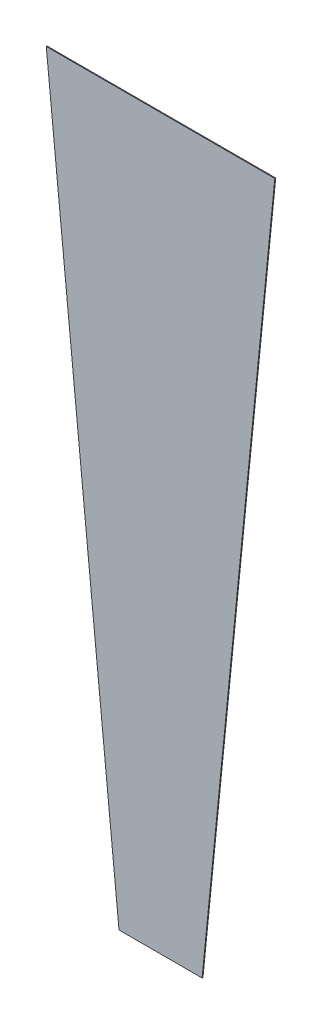
ISO-10303-21;
HEADER;
FILE_DESCRIPTION(('STEP AP214'),'2;1');
FILE_NAME('part.step','',(''),(''),'','','');
FILE_SCHEMA(('AUTOMOTIVE_DESIGN { 1 0 10303 214 1 1 1 1 }'));
ENDSEC;
DATA;
#1=APPLICATION_CONTEXT('core data for automotive mechanical design processes');
#2=APPLICATION_PROTOCOL_DEFINITION('international standard','automotive_design',2000,#1);
#3=PRODUCT_CONTEXT('',#1,'mechanical');
#4=PRODUCT('Part','Part','',(#3));
#5=PRODUCT_RELATED_PRODUCT_CATEGORY('part','',(#4));
#6=PRODUCT_DEFINITION_FORMATION('','',#4);
#7=PRODUCT_DEFINITION_CONTEXT('part definition',#1,'design');
#8=PRODUCT_DEFINITION('design','',#6,#7);
#9=PRODUCT_DEFINITION_SHAPE('','',#8);
#10=(LENGTH_UNIT() NAMED_UNIT(*) SI_UNIT(.MILLI.,.METRE.));
#11=(NAMED_UNIT(*) PLANE_ANGLE_UNIT() SI_UNIT($,.RADIAN.));
#12=(NAMED_UNIT(*) SI_UNIT($,.STERADIAN.) SOLID_ANGLE_UNIT());
#13=UNCERTAINTY_MEASURE_WITH_UNIT(LENGTH_MEASURE(1.E-05),#10,'distance_accuracy_value','');
#14=(GEOMETRIC_REPRESENTATION_CONTEXT(3) GLOBAL_UNCERTAINTY_ASSIGNED_CONTEXT((#13)) GLOBAL_UNIT_ASSIGNED_CONTEXT((#10,
#11,#12)) REPRESENTATION_CONTEXT('',''));
#15=CARTESIAN_POINT('',(0.,0.,0.));
#16=DIRECTION('',(0.,0.,1.));
#17=DIRECTION('',(1.,0.,0.));
#18=AXIS2_PLACEMENT_3D('',#15,#16,#17);
#19=CARTESIAN_POINT('',(-104.963976,-655.465288,6.3754));
#20=DIRECTION('',(0.,0.,1.));
#21=DIRECTION('',(1.,0.,0.));
#22=AXIS2_PLACEMENT_3D('',#19,#20,#21);
#23=PLANE('',#22);
#24=DIRECTION('',(-0.0993248441126649,-0.995055061462427,0.));
#25=VECTOR('',#24,1.);
#26=CARTESIAN_POINT('',(68.8086,-320.8274,6.3754));
#27=LINE('',#26,#25);
#28=CARTESIAN_POINT('',(36.6903,-642.5946,6.3754));
#29=VERTEX_POINT('',#28);
#30=CARTESIAN_POINT('',(100.9269,0.939800000000036,6.3754));
#31=VERTEX_POINT('',#30);
#32=EDGE_CURVE('E87',#29,#31,#27,.F.);
#33=ORIENTED_EDGE('',*,*,#32,.T.);
#34=DIRECTION('',(1.,0.,0.));
#35=VECTOR('',#34,1.);
#36=CARTESIAN_POINT('',(0.,0.9398,6.3754));
#37=LINE('',#36,#35);
#38=CARTESIAN_POINT('',(-100.9269,0.939800000000024,6.3754));
#39=VERTEX_POINT('',#38);
#40=EDGE_CURVE('E67',#31,#39,#37,.F.);
#41=ORIENTED_EDGE('',*,*,#40,.T.);
#42=DIRECTION('',(-0.0993248441126649,0.995055061462427,0.));
#43=VECTOR('',#42,1.);
#44=CARTESIAN_POINT('',(-68.8086,-320.8274,6.3754));
#45=LINE('',#44,#43);
#46=CARTESIAN_POINT('',(-36.6903,-642.5946,6.3754));
#47=VERTEX_POINT('',#46);
#48=EDGE_CURVE('E54',#39,#47,#45,.F.);
#49=ORIENTED_EDGE('',*,*,#48,.T.);
#50=DIRECTION('',(-1.,0.,0.));
#51=VECTOR('',#50,1.);
#52=CARTESIAN_POINT('',(0.,-642.5946,6.3754));
#53=LINE('',#52,#51);
#54=EDGE_CURVE('E65',#47,#29,#53,.F.);
#55=ORIENTED_EDGE('',*,*,#54,.T.);
#56=EDGE_LOOP('',(#33,#41,#49,#55));
#57=FACE_BOUND('',#56,.T.);
#58=ADVANCED_FACE('F17',(#57),#23,.T.);
#59=CARTESIAN_POINT('',(-102.211632,13.810488,5.59816));
#60=DIRECTION('',(-0.995055061462427,-0.0993248441126649,0.));
#61=DIRECTION('',(0.0993248441126649,-0.995055061462427,0.));
#62=AXIS2_PLACEMENT_3D('',#59,#60,#61);
#63=PLANE('',#62);
#64=ORIENTED_EDGE('',*,*,#48,.F.);
#65=DIRECTION('',(0.,0.,1.));
#66=VECTOR('',#65,1.);
#67=CARTESIAN_POINT('',(-100.9269,0.9398,5.9944));
#68=LINE('',#67,#66);
#69=CARTESIAN_POINT('',(-100.9269,0.939800000000037,5.6134));
#70=VERTEX_POINT('',#69);
#71=EDGE_CURVE('E79',#39,#70,#68,.F.);
#72=ORIENTED_EDGE('',*,*,#71,.T.);
#73=DIRECTION('',(0.0993248441126649,-0.995055061462427,0.));
#74=VECTOR('',#73,1.);
#75=CARTESIAN_POINT('',(-102.211632,13.810488,5.6134));
#76=LINE('',#75,#74);
#77=CARTESIAN_POINT('',(-36.6903,-642.5946,5.6134));
#78=VERTEX_POINT('',#77);
#79=EDGE_CURVE('E21',#70,#78,#76,.T.);
#80=ORIENTED_EDGE('',*,*,#79,.T.);
#81=DIRECTION('',(0.,0.,-1.));
#82=VECTOR('',#81,1.);
#83=CARTESIAN_POINT('',(-36.6903,-642.5946,5.9944));
#84=LINE('',#83,#82);
#85=EDGE_CURVE('E68',#78,#47,#84,.F.);
#86=ORIENTED_EDGE('',*,*,#85,.T.);
#87=EDGE_LOOP('',(#64,#72,#80,#86));
#88=FACE_BOUND('',#87,.T.);
#89=ADVANCED_FACE('F76',(#88),#63,.T.);
#90=CARTESIAN_POINT('',(-38.157912,-642.5946,5.59816));
#91=DIRECTION('',(0.,-1.,0.));
#92=DIRECTION('',(1.,0.,0.));
#93=AXIS2_PLACEMENT_3D('',#90,#91,#92);
#94=PLANE('',#93);
#95=ORIENTED_EDGE('',*,*,#54,.F.);
#96=ORIENTED_EDGE('',*,*,#85,.F.);
#97=DIRECTION('',(1.,0.,0.));
#98=VECTOR('',#97,1.);
#99=CARTESIAN_POINT('',(0.,-642.5946,5.6134));
#100=LINE('',#99,#98);
#101=CARTESIAN_POINT('',(36.6903,-642.5946,5.6134));
#102=VERTEX_POINT('',#101);
#103=EDGE_CURVE('E81',#78,#102,#100,.T.);
#104=ORIENTED_EDGE('',*,*,#103,.T.);
#105=DIRECTION('',(0.,0.,-1.));
#106=VECTOR('',#105,1.);
#107=CARTESIAN_POINT('',(36.6903,-642.5946,5.9944));
#108=LINE('',#107,#106);
#109=EDGE_CURVE('E74',#102,#29,#108,.F.);
#110=ORIENTED_EDGE('',*,*,#109,.T.);
#111=EDGE_LOOP('',(#95,#96,#104,#110));
#112=FACE_BOUND('',#111,.T.);
#113=ADVANCED_FACE('F72',(#112),#94,.T.);
#114=CARTESIAN_POINT('',(35.405568,-655.465288,5.59816));
#115=DIRECTION('',(0.995055061462427,-0.0993248441126649,0.));
#116=DIRECTION('',(0.0993248441126649,0.995055061462427,0.));
#117=AXIS2_PLACEMENT_3D('',#114,#115,#116);
#118=PLANE('',#117);
#119=ORIENTED_EDGE('',*,*,#32,.F.);
#120=ORIENTED_EDGE('',*,*,#109,.F.);
#121=DIRECTION('',(0.0993248441126649,0.995055061462427,0.));
#122=VECTOR('',#121,1.);
#123=CARTESIAN_POINT('',(35.405568,-655.465288,5.6134));
#124=LINE('',#123,#122);
#125=CARTESIAN_POINT('',(100.9269,0.939800000000064,5.6134));
#126=VERTEX_POINT('',#125);
#127=EDGE_CURVE('E27',#102,#126,#124,.T.);
#128=ORIENTED_EDGE('',*,*,#127,.T.);
#129=DIRECTION('',(0.,0.,-1.));
#130=VECTOR('',#129,1.);
#131=CARTESIAN_POINT('',(100.9269,0.9398,5.9944));
#132=LINE('',#131,#130);
#133=EDGE_CURVE('E35',#126,#31,#132,.F.);
#134=ORIENTED_EDGE('',*,*,#133,.T.);
#135=EDGE_LOOP('',(#119,#120,#128,#134));
#136=FACE_BOUND('',#135,.T.);
#137=ADVANCED_FACE('F96',(#136),#118,.T.);
#138=CARTESIAN_POINT('',(104.963976,0.9398,5.59816));
#139=DIRECTION('',(0.,1.,0.));
#140=DIRECTION('',(-1.,0.,0.));
#141=AXIS2_PLACEMENT_3D('',#138,#139,#140);
#142=PLANE('',#141);
#143=ORIENTED_EDGE('',*,*,#40,.F.);
#144=ORIENTED_EDGE('',*,*,#133,.F.);
#145=DIRECTION('',(-1.,0.,0.));
#146=VECTOR('',#145,1.);
#147=CARTESIAN_POINT('',(0.,0.93980000000005,5.6134));
#148=LINE('',#147,#146);
#149=EDGE_CURVE('E11',#126,#70,#148,.T.);
#150=ORIENTED_EDGE('',*,*,#149,.T.);
#151=ORIENTED_EDGE('',*,*,#71,.F.);
#152=EDGE_LOOP('',(#143,#144,#150,#151));
#153=FACE_BOUND('',#152,.T.);
#154=ADVANCED_FACE('F90',(#153),#142,.T.);
#155=CARTESIAN_POINT('',(-104.963976,-655.465288,5.6134));
#156=DIRECTION('',(0.,0.,1.));
#157=DIRECTION('',(1.,0.,0.));
#158=AXIS2_PLACEMENT_3D('',#155,#156,#157);
#159=PLANE('',#158);
#160=ORIENTED_EDGE('',*,*,#127,.F.);
#161=ORIENTED_EDGE('',*,*,#103,.F.);
#162=ORIENTED_EDGE('',*,*,#79,.F.);
#163=ORIENTED_EDGE('',*,*,#149,.F.);
#164=EDGE_LOOP('',(#160,#161,#162,#163));
#165=FACE_BOUND('',#164,.T.);
#166=ADVANCED_FACE('F19',(#165),#159,.F.);
#167=CLOSED_SHELL('',(#58,#89,#113,#137,#154,#166));
#168=MANIFOLD_SOLID_BREP('B1',#167);
#169=ADVANCED_BREP_SHAPE_REPRESENTATION('',(#18,#168),#14);
#170=SHAPE_DEFINITION_REPRESENTATION(#9,#169);
ENDSEC;
END-ISO-10303-21;
